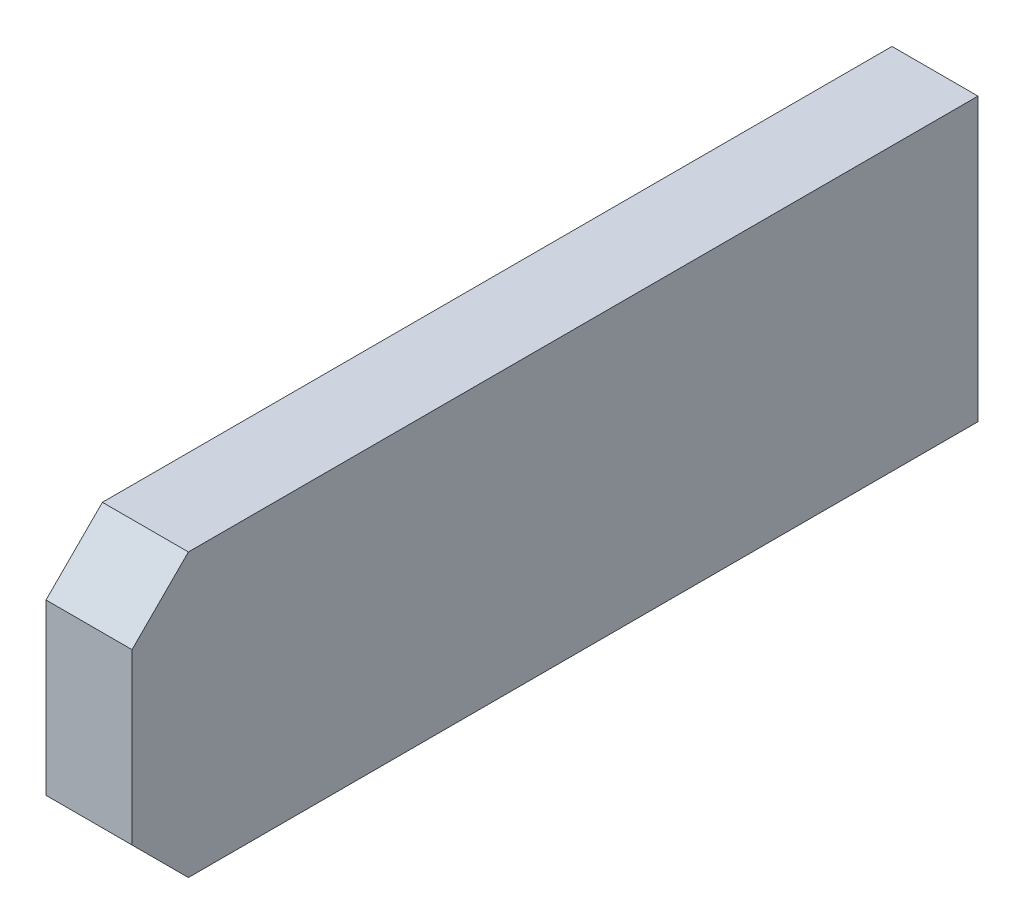
ISO-10303-21;
HEADER;
FILE_DESCRIPTION(('STEP AP214'),'2;1');
FILE_NAME('part.step','',(''),(''),'','','');
FILE_SCHEMA(('AUTOMOTIVE_DESIGN { 1 0 10303 214 1 1 1 1 }'));
ENDSEC;
DATA;
#1=APPLICATION_CONTEXT('core data for automotive mechanical design processes');
#2=APPLICATION_PROTOCOL_DEFINITION('international standard','automotive_design',2000,#1);
#3=PRODUCT_CONTEXT('',#1,'mechanical');
#4=PRODUCT('Part','Part','',(#3));
#5=PRODUCT_RELATED_PRODUCT_CATEGORY('part','',(#4));
#6=PRODUCT_DEFINITION_FORMATION('','',#4);
#7=PRODUCT_DEFINITION_CONTEXT('part definition',#1,'design');
#8=PRODUCT_DEFINITION('design','',#6,#7);
#9=PRODUCT_DEFINITION_SHAPE('','',#8);
#10=(LENGTH_UNIT() NAMED_UNIT(*) SI_UNIT(.MILLI.,.METRE.));
#11=(NAMED_UNIT(*) PLANE_ANGLE_UNIT() SI_UNIT($,.RADIAN.));
#12=(NAMED_UNIT(*) SI_UNIT($,.STERADIAN.) SOLID_ANGLE_UNIT());
#13=UNCERTAINTY_MEASURE_WITH_UNIT(LENGTH_MEASURE(1.E-05),#10,'distance_accuracy_value','');
#14=(GEOMETRIC_REPRESENTATION_CONTEXT(3) GLOBAL_UNCERTAINTY_ASSIGNED_CONTEXT((#13)) GLOBAL_UNIT_ASSIGNED_CONTEXT((#10,
#11,#12)) REPRESENTATION_CONTEXT('',''));
#15=CARTESIAN_POINT('',(0.,0.,0.));
#16=DIRECTION('',(0.,0.,1.));
#17=DIRECTION('',(1.,0.,0.));
#18=AXIS2_PLACEMENT_3D('',#15,#16,#17);
#19=CARTESIAN_POINT('',(58.47457889831,0.,0.));
#20=DIRECTION('',(1.,0.,0.));
#21=DIRECTION('',(0.,0.,-1.));
#22=AXIS2_PLACEMENT_3D('',#19,#20,#21);
#23=PLANE('',#22);
#24=DIRECTION('',(0.,1.,0.));
#25=VECTOR('',#24,1.);
#26=CARTESIAN_POINT('',(58.47457889831,-9.921262189784,6.900000000046));
#27=LINE('',#26,#25);
#28=CARTESIAN_POINT('',(58.47457889831,-10.12126218978,6.900000000046));
#29=VERTEX_POINT('',#28);
#30=CARTESIAN_POINT('',(58.47457889831,-10.72126218978,6.900000000046));
#31=VERTEX_POINT('',#30);
#32=EDGE_CURVE('E95',#29,#31,#27,.F.);
#33=ORIENTED_EDGE('',*,*,#32,.F.);
#34=DIRECTION('',(0.,-0.707106781186548,0.707106781186548));
#35=VECTOR('',#34,1.);
#36=CARTESIAN_POINT('',(58.47457889831,-10.12126218978,6.900000000046));
#37=LINE('',#36,#35);
#38=CARTESIAN_POINT('',(58.47457889831,-9.9212621897835,6.7000000000465));
#39=VERTEX_POINT('',#38);
#40=EDGE_CURVE('E74',#39,#29,#37,.T.);
#41=ORIENTED_EDGE('',*,*,#40,.F.);
#42=DIRECTION('',(0.,0.,-1.));
#43=VECTOR('',#42,1.);
#44=CARTESIAN_POINT('',(58.47457889831,-9.921262189784,3.900000000046));
#45=LINE('',#44,#43);
#46=CARTESIAN_POINT('',(58.47457889831,-9.921262189784,3.900000000046));
#47=VERTEX_POINT('',#46);
#48=EDGE_CURVE('E68',#39,#47,#45,.T.);
#49=ORIENTED_EDGE('',*,*,#48,.T.);
#50=DIRECTION('',(0.,1.,0.));
#51=VECTOR('',#50,1.);
#52=CARTESIAN_POINT('',(58.47457889831,-9.921262189784,3.900000000046));
#53=LINE('',#52,#51);
#54=CARTESIAN_POINT('',(58.47457889831,-10.92126218978,3.900000000046));
#55=VERTEX_POINT('',#54);
#56=EDGE_CURVE('E20',#55,#47,#53,.T.);
#57=ORIENTED_EDGE('',*,*,#56,.F.);
#58=DIRECTION('',(0.,0.,1.));
#59=VECTOR('',#58,1.);
#60=CARTESIAN_POINT('',(58.47457889831,-10.92126218978,8.900000000046));
#61=LINE('',#60,#59);
#62=CARTESIAN_POINT('',(58.47457889831,-10.92126218978,6.700000000046));
#63=VERTEX_POINT('',#62);
#64=EDGE_CURVE('E102',#55,#63,#61,.T.);
#65=ORIENTED_EDGE('',*,*,#64,.T.);
#66=DIRECTION('',(0.,-0.707106781186548,-0.707106781186548));
#67=VECTOR('',#66,1.);
#68=CARTESIAN_POINT('',(58.47457889831,-10.92126218978,6.700000000046));
#69=LINE('',#68,#67);
#70=EDGE_CURVE('E100',#31,#63,#69,.T.);
#71=ORIENTED_EDGE('',*,*,#70,.F.);
#72=EDGE_LOOP('',(#33,#41,#49,#57,#65,#71));
#73=FACE_BOUND('',#72,.T.);
#74=ADVANCED_FACE('F17',(#73),#23,.F.);
#75=CARTESIAN_POINT('',(58.42957889831,-9.921262189784,3.900000000046));
#76=DIRECTION('',(0.,0.,-1.));
#77=DIRECTION('',(-1.,0.,0.));
#78=AXIS2_PLACEMENT_3D('',#75,#76,#77);
#79=PLANE('',#78);
#80=DIRECTION('',(1.,0.,0.));
#81=VECTOR('',#80,1.);
#82=CARTESIAN_POINT('',(58.42957889831,-9.921262189784,3.900000000046));
#83=LINE('',#82,#81);
#84=CARTESIAN_POINT('',(58.77957889831,-9.921262189784,3.900000000046));
#85=VERTEX_POINT('',#84);
#86=EDGE_CURVE('E76',#47,#85,#83,.T.);
#87=ORIENTED_EDGE('',*,*,#86,.T.);
#88=DIRECTION('',(0.,1.,0.));
#89=VECTOR('',#88,1.);
#90=CARTESIAN_POINT('',(58.77957889831,-9.921262189784,3.900000000046));
#91=LINE('',#90,#89);
#92=CARTESIAN_POINT('',(58.77957889831,-10.92126218978,3.900000000046));
#93=VERTEX_POINT('',#92);
#94=EDGE_CURVE('E106',#93,#85,#91,.T.);
#95=ORIENTED_EDGE('',*,*,#94,.F.);
#96=DIRECTION('',(1.,0.,0.));
#97=VECTOR('',#96,1.);
#98=CARTESIAN_POINT('',(45.04957889831,-10.92126218978,3.900000000046));
#99=LINE('',#98,#97);
#100=EDGE_CURVE('E81',#93,#55,#99,.F.);
#101=ORIENTED_EDGE('',*,*,#100,.T.);
#102=ORIENTED_EDGE('',*,*,#56,.T.);
#103=EDGE_LOOP('',(#87,#95,#101,#102));
#104=FACE_BOUND('',#103,.T.);
#105=ADVANCED_FACE('F78',(#104),#79,.T.);
#106=CARTESIAN_POINT('',(58.42957889831,-9.921262189784,3.900000000046));
#107=DIRECTION('',(0.,-1.,0.));
#108=DIRECTION('',(0.,0.,-1.));
#109=AXIS2_PLACEMENT_3D('',#106,#107,#108);
#110=PLANE('',#109);
#111=DIRECTION('',(0.,0.,-1.));
#112=VECTOR('',#111,1.);
#113=CARTESIAN_POINT('',(58.77957889831,-9.921262189784,6.900000000046));
#114=LINE('',#113,#112);
#115=CARTESIAN_POINT('',(58.77957889831,-9.9212621897835,6.7000000000465));
#116=VERTEX_POINT('',#115);
#117=EDGE_CURVE('E85',#85,#116,#114,.F.);
#118=ORIENTED_EDGE('',*,*,#117,.F.);
#119=ORIENTED_EDGE('',*,*,#86,.F.);
#120=ORIENTED_EDGE('',*,*,#48,.F.);
#121=DIRECTION('',(1.,0.,0.));
#122=VECTOR('',#121,1.);
#123=CARTESIAN_POINT('',(58.42957889831,-9.921262189782,6.700000000048));
#124=LINE('',#123,#122);
#125=EDGE_CURVE('E87',#116,#39,#124,.F.);
#126=ORIENTED_EDGE('',*,*,#125,.F.);
#127=EDGE_LOOP('',(#118,#119,#120,#126));
#128=FACE_BOUND('',#127,.T.);
#129=ADVANCED_FACE('F83',(#128),#110,.F.);
#130=CARTESIAN_POINT('',(58.42957889831,-10.12126218978,6.900000000046));
#131=DIRECTION('',(0.,0.707106781186548,0.707106781186548));
#132=DIRECTION('',(0.,-0.707106781186548,0.707106781186548));
#133=AXIS2_PLACEMENT_3D('',#130,#131,#132);
#134=PLANE('',#133);
#135=DIRECTION('',(1.,0.,0.));
#136=VECTOR('',#135,1.);
#137=CARTESIAN_POINT('',(58.42957889831,-10.12126218978,6.900000000046));
#138=LINE('',#137,#136);
#139=CARTESIAN_POINT('',(58.77957889831,-10.12126218978,6.900000000046));
#140=VERTEX_POINT('',#139);
#141=EDGE_CURVE('E92',#140,#29,#138,.F.);
#142=ORIENTED_EDGE('',*,*,#141,.F.);
#143=DIRECTION('',(0.,-0.707106781179473,0.707106781193622));
#144=VECTOR('',#143,1.);
#145=CARTESIAN_POINT('',(58.77957889831,-9.921262189784,6.700000000046));
#146=LINE('',#145,#144);
#147=EDGE_CURVE('E109',#116,#140,#146,.T.);
#148=ORIENTED_EDGE('',*,*,#147,.F.);
#149=ORIENTED_EDGE('',*,*,#125,.T.);
#150=ORIENTED_EDGE('',*,*,#40,.T.);
#151=EDGE_LOOP('',(#142,#148,#149,#150));
#152=FACE_BOUND('',#151,.T.);
#153=ADVANCED_FACE('F137',(#152),#134,.T.);
#154=CARTESIAN_POINT('',(58.42957889831,-9.921262189784,6.900000000046));
#155=DIRECTION('',(0.,0.,1.));
#156=DIRECTION('',(1.,0.,0.));
#157=AXIS2_PLACEMENT_3D('',#154,#155,#156);
#158=PLANE('',#157);
#159=DIRECTION('',(1.,0.,0.));
#160=VECTOR('',#159,1.);
#161=CARTESIAN_POINT('',(45.04957889831,-10.72126218978,6.900000000046));
#162=LINE('',#161,#160);
#163=CARTESIAN_POINT('',(58.77957889831,-10.72126218978,6.900000000046));
#164=VERTEX_POINT('',#163);
#165=EDGE_CURVE('E97',#164,#31,#162,.F.);
#166=ORIENTED_EDGE('',*,*,#165,.F.);
#167=DIRECTION('',(0.,1.,0.));
#168=VECTOR('',#167,1.);
#169=CARTESIAN_POINT('',(58.77957889831,-9.921262189784,6.900000000046));
#170=LINE('',#169,#168);
#171=EDGE_CURVE('E112',#140,#164,#170,.F.);
#172=ORIENTED_EDGE('',*,*,#171,.F.);
#173=ORIENTED_EDGE('',*,*,#141,.T.);
#174=ORIENTED_EDGE('',*,*,#32,.T.);
#175=EDGE_LOOP('',(#166,#172,#173,#174));
#176=FACE_BOUND('',#175,.T.);
#177=ADVANCED_FACE('F122',(#176),#158,.T.);
#178=CARTESIAN_POINT('',(45.04957889831,-10.92126218978,6.700000000046));
#179=DIRECTION('',(0.,-0.707106781186548,0.707106781186548));
#180=DIRECTION('',(0.,-0.707106781186548,-0.707106781186548));
#181=AXIS2_PLACEMENT_3D('',#178,#179,#180);
#182=PLANE('',#181);
#183=DIRECTION('',(1.,0.,0.));
#184=VECTOR('',#183,1.);
#185=CARTESIAN_POINT('',(45.04957889831,-10.92126218978,6.700000000046));
#186=LINE('',#185,#184);
#187=CARTESIAN_POINT('',(58.77957889831,-10.92126218978,6.700000000046));
#188=VERTEX_POINT('',#187);
#189=EDGE_CURVE('E35',#63,#188,#186,.T.);
#190=ORIENTED_EDGE('',*,*,#189,.T.);
#191=DIRECTION('',(0.,-0.707106781186547,-0.707106781186547));
#192=VECTOR('',#191,1.);
#193=CARTESIAN_POINT('',(58.77957889831,-10.72126218978,6.900000000046));
#194=LINE('',#193,#192);
#195=EDGE_CURVE('E26',#164,#188,#194,.T.);
#196=ORIENTED_EDGE('',*,*,#195,.F.);
#197=ORIENTED_EDGE('',*,*,#165,.T.);
#198=ORIENTED_EDGE('',*,*,#70,.T.);
#199=EDGE_LOOP('',(#190,#196,#197,#198));
#200=FACE_BOUND('',#199,.T.);
#201=ADVANCED_FACE('F119',(#200),#182,.T.);
#202=CARTESIAN_POINT('',(45.04957889831,-10.92126218978,8.900000000046));
#203=DIRECTION('',(0.,1.,0.));
#204=DIRECTION('',(0.,0.,1.));
#205=AXIS2_PLACEMENT_3D('',#202,#203,#204);
#206=PLANE('',#205);
#207=DIRECTION('',(0.,0.,-1.));
#208=VECTOR('',#207,1.);
#209=CARTESIAN_POINT('',(58.77957889831,-10.92126218978,6.900000000046));
#210=LINE('',#209,#208);
#211=EDGE_CURVE('E11',#188,#93,#210,.T.);
#212=ORIENTED_EDGE('',*,*,#211,.F.);
#213=ORIENTED_EDGE('',*,*,#189,.F.);
#214=ORIENTED_EDGE('',*,*,#64,.F.);
#215=ORIENTED_EDGE('',*,*,#100,.F.);
#216=EDGE_LOOP('',(#212,#213,#214,#215));
#217=FACE_BOUND('',#216,.T.);
#218=ADVANCED_FACE('F124',(#217),#206,.F.);
#219=CARTESIAN_POINT('',(58.77957889831,-9.921262189784,6.900000000046));
#220=DIRECTION('',(1.,0.,0.));
#221=DIRECTION('',(0.,0.,-1.));
#222=AXIS2_PLACEMENT_3D('',#219,#220,#221);
#223=PLANE('',#222);
#224=ORIENTED_EDGE('',*,*,#195,.T.);
#225=ORIENTED_EDGE('',*,*,#211,.T.);
#226=ORIENTED_EDGE('',*,*,#94,.T.);
#227=ORIENTED_EDGE('',*,*,#117,.T.);
#228=ORIENTED_EDGE('',*,*,#147,.T.);
#229=ORIENTED_EDGE('',*,*,#171,.T.);
#230=EDGE_LOOP('',(#224,#225,#226,#227,#228,#229));
#231=FACE_BOUND('',#230,.T.);
#232=ADVANCED_FACE('F117',(#231),#223,.T.);
#233=CLOSED_SHELL('',(#74,#105,#129,#153,#177,#201,#218,#232));
#234=MANIFOLD_SOLID_BREP('B1',#233);
#235=ADVANCED_BREP_SHAPE_REPRESENTATION('',(#18,#234),#14);
#236=SHAPE_DEFINITION_REPRESENTATION(#9,#235);
ENDSEC;
END-ISO-10303-21;
